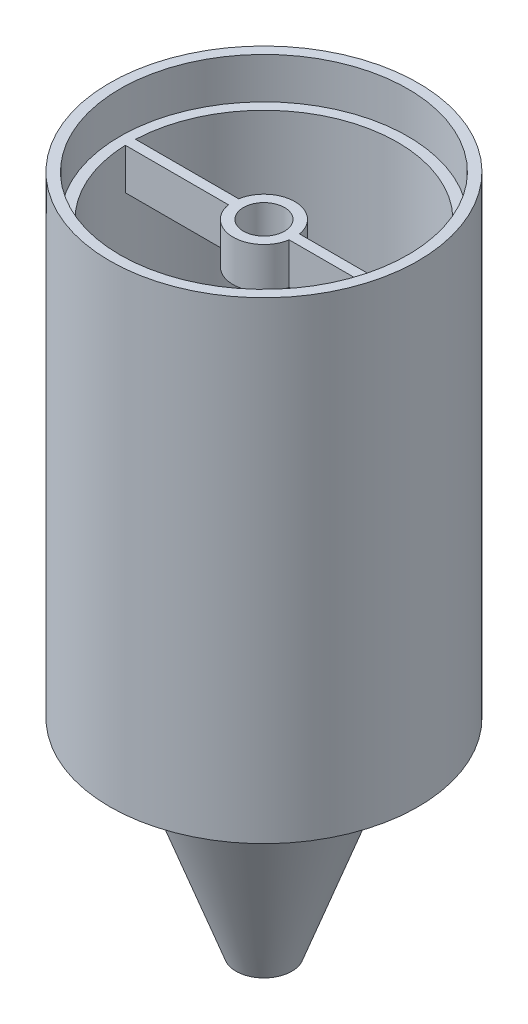
ISO-10303-21;
HEADER;
FILE_DESCRIPTION(('STEP AP214'),'2;1');
FILE_NAME('part.step','',(''),(''),'','','');
FILE_SCHEMA(('AUTOMOTIVE_DESIGN { 1 0 10303 214 1 1 1 1 }'));
ENDSEC;
DATA;
#1=APPLICATION_CONTEXT('core data for automotive mechanical design processes');
#2=APPLICATION_PROTOCOL_DEFINITION('international standard','automotive_design',2000,#1);
#3=PRODUCT_CONTEXT('',#1,'mechanical');
#4=PRODUCT('Part','Part','',(#3));
#5=PRODUCT_RELATED_PRODUCT_CATEGORY('part','',(#4));
#6=PRODUCT_DEFINITION_FORMATION('','',#4);
#7=PRODUCT_DEFINITION_CONTEXT('part definition',#1,'design');
#8=PRODUCT_DEFINITION('design','',#6,#7);
#9=PRODUCT_DEFINITION_SHAPE('','',#8);
#10=(LENGTH_UNIT() NAMED_UNIT(*) SI_UNIT(.MILLI.,.METRE.));
#11=(NAMED_UNIT(*) PLANE_ANGLE_UNIT() SI_UNIT($,.RADIAN.));
#12=(NAMED_UNIT(*) SI_UNIT($,.STERADIAN.) SOLID_ANGLE_UNIT());
#13=UNCERTAINTY_MEASURE_WITH_UNIT(LENGTH_MEASURE(1.E-05),#10,'distance_accuracy_value','');
#14=(GEOMETRIC_REPRESENTATION_CONTEXT(3) GLOBAL_UNCERTAINTY_ASSIGNED_CONTEXT((#13)) GLOBAL_UNIT_ASSIGNED_CONTEXT((#10,
#11,#12)) REPRESENTATION_CONTEXT('',''));
#15=CARTESIAN_POINT('',(0.,0.,0.));
#16=DIRECTION('',(0.,0.,1.));
#17=DIRECTION('',(1.,0.,0.));
#18=AXIS2_PLACEMENT_3D('',#15,#16,#17);
#19=CARTESIAN_POINT('',(0.,53.34,0.));
#20=DIRECTION('',(0.,-1.,0.));
#21=DIRECTION('',(0.,0.,-1.));
#22=AXIS2_PLACEMENT_3D('',#19,#20,#21);
#23=CYLINDRICAL_SURFACE('',#22,16.51);
#24=CARTESIAN_POINT('',(0.,2.54,0.));
#25=DIRECTION('',(0.,1.,0.));
#26=DIRECTION('',(0.,0.,1.));
#27=AXIS2_PLACEMENT_3D('',#24,#25,#26);
#28=CIRCLE('',#27,16.51);
#29=CARTESIAN_POINT('',(0.,2.54,16.51));
#30=VERTEX_POINT('',#29);
#31=EDGE_CURVE('E181',#30,#30,#28,.F.);
#32=ORIENTED_EDGE('',*,*,#31,.T.);
#33=EDGE_LOOP('',(#32));
#34=FACE_BOUND('',#33,.T.);
#35=CARTESIAN_POINT('',(0.,48.26,0.));
#36=DIRECTION('',(0.,1.,0.));
#37=DIRECTION('',(0.,0.,1.));
#38=AXIS2_PLACEMENT_3D('',#35,#36,#37);
#39=CIRCLE('',#38,16.51);
#40=CARTESIAN_POINT('',(-16.4977839420936,48.26,-0.635000000000003));
#41=VERTEX_POINT('',#40);
#42=CARTESIAN_POINT('',(-16.4977839420936,48.26,0.634999999999997));
#43=VERTEX_POINT('',#42);
#44=EDGE_CURVE('E183',#41,#43,#39,.T.);
#45=ORIENTED_EDGE('',*,*,#44,.T.);
#46=DIRECTION('',(0.,1.,0.));
#47=VECTOR('',#46,1.);
#48=CARTESIAN_POINT('',(-16.4977839420936,48.26,0.634999999999997));
#49=LINE('',#48,#47);
#50=CARTESIAN_POINT('',(-16.4977839420936,53.34,0.634999999999997));
#51=VERTEX_POINT('',#50);
#52=EDGE_CURVE('E105',#43,#51,#49,.T.);
#53=ORIENTED_EDGE('',*,*,#52,.T.);
#54=CARTESIAN_POINT('',(0.,53.34,0.));
#55=DIRECTION('',(0.,1.,0.));
#56=DIRECTION('',(0.,0.,1.));
#57=AXIS2_PLACEMENT_3D('',#54,#55,#56);
#58=CIRCLE('',#57,16.51);
#59=CARTESIAN_POINT('',(16.4977839420936,53.34,0.634999999999997));
#60=VERTEX_POINT('',#59);
#61=EDGE_CURVE('E160',#51,#60,#58,.T.);
#62=ORIENTED_EDGE('',*,*,#61,.T.);
#63=DIRECTION('',(0.,1.,0.));
#64=VECTOR('',#63,1.);
#65=CARTESIAN_POINT('',(16.4977839420936,48.26,0.634999999999997));
#66=LINE('',#65,#64);
#67=CARTESIAN_POINT('',(16.4977839420936,48.26,0.634999999999997));
#68=VERTEX_POINT('',#67);
#69=EDGE_CURVE('E113',#68,#60,#66,.T.);
#70=ORIENTED_EDGE('',*,*,#69,.F.);
#71=CARTESIAN_POINT('',(16.4977839420936,48.26,-0.635000000000003));
#72=VERTEX_POINT('',#71);
#73=EDGE_CURVE('E41',#68,#72,#39,.T.);
#74=ORIENTED_EDGE('',*,*,#73,.T.);
#75=DIRECTION('',(0.,1.,0.));
#76=VECTOR('',#75,1.);
#77=CARTESIAN_POINT('',(16.4977839420936,48.26,-0.635000000000003));
#78=LINE('',#77,#76);
#79=CARTESIAN_POINT('',(16.4977839420936,53.34,-0.635000000000003));
#80=VERTEX_POINT('',#79);
#81=EDGE_CURVE('E148',#72,#80,#78,.T.);
#82=ORIENTED_EDGE('',*,*,#81,.T.);
#83=CARTESIAN_POINT('',(-16.4977839420936,53.34,-0.635000000000003));
#84=VERTEX_POINT('',#83);
#85=EDGE_CURVE('E165',#80,#84,#58,.T.);
#86=ORIENTED_EDGE('',*,*,#85,.T.);
#87=DIRECTION('',(0.,1.,0.));
#88=VECTOR('',#87,1.);
#89=CARTESIAN_POINT('',(-16.4977839420936,48.26,-0.635000000000003));
#90=LINE('',#89,#88);
#91=EDGE_CURVE('E141',#41,#84,#90,.T.);
#92=ORIENTED_EDGE('',*,*,#91,.F.);
#93=EDGE_LOOP('',(#45,#53,#62,#70,#74,#82,#86,#92));
#94=FACE_BOUND('',#93,.T.);
#95=ADVANCED_FACE('F33',(#34,#94),#23,.F.);
#96=CARTESIAN_POINT('',(0.,0.,0.));
#97=DIRECTION('',(0.,1.,0.));
#98=DIRECTION('',(0.,0.,1.));
#99=AXIS2_PLACEMENT_3D('',#96,#97,#98);
#100=PLANE('',#99);
#101=CARTESIAN_POINT('',(0.,0.,0.));
#102=DIRECTION('',(0.,1.,0.));
#103=DIRECTION('',(0.,0.,1.));
#104=AXIS2_PLACEMENT_3D('',#101,#102,#103);
#105=CIRCLE('',#104,19.05);
#106=CARTESIAN_POINT('',(0.,0.,19.05));
#107=VERTEX_POINT('',#106);
#108=EDGE_CURVE('E175',#107,#107,#105,.T.);
#109=ORIENTED_EDGE('',*,*,#108,.F.);
#110=EDGE_LOOP('',(#109));
#111=FACE_BOUND('',#110,.T.);
#112=CARTESIAN_POINT('',(0.,0.,0.));
#113=DIRECTION('',(0.,1.,0.));
#114=DIRECTION('',(0.,0.,1.));
#115=AXIS2_PLACEMENT_3D('',#112,#113,#114);
#116=CIRCLE('',#115,12.7);
#117=CARTESIAN_POINT('',(0.,0.,12.7));
#118=VERTEX_POINT('',#117);
#119=EDGE_CURVE('E178',#118,#118,#116,.F.);
#120=ORIENTED_EDGE('',*,*,#119,.F.);
#121=EDGE_LOOP('',(#120));
#122=FACE_BOUND('',#121,.T.);
#123=ADVANCED_FACE('F227',(#111,#122),#100,.F.);
#124=CARTESIAN_POINT('',(0.,2.54,0.));
#125=DIRECTION('',(0.,-1.,0.));
#126=DIRECTION('',(0.,0.,-1.));
#127=AXIS2_PLACEMENT_3D('',#124,#125,#126);
#128=CYLINDRICAL_SURFACE('',#127,19.05);
#129=ORIENTED_EDGE('',*,*,#108,.T.);
#130=EDGE_LOOP('',(#129));
#131=FACE_BOUND('',#130,.T.);
#132=CARTESIAN_POINT('',(0.,58.42,0.));
#133=DIRECTION('',(0.,1.,0.));
#134=DIRECTION('',(0.,0.,1.));
#135=AXIS2_PLACEMENT_3D('',#132,#133,#134);
#136=CIRCLE('',#135,19.05);
#137=CARTESIAN_POINT('',(0.,58.42,19.05));
#138=VERTEX_POINT('',#137);
#139=EDGE_CURVE('E124',#138,#138,#136,.T.);
#140=ORIENTED_EDGE('',*,*,#139,.F.);
#141=EDGE_LOOP('',(#140));
#142=FACE_BOUND('',#141,.T.);
#143=ADVANCED_FACE('F35',(#131,#142),#128,.T.);
#144=CARTESIAN_POINT('',(0.,2.54,0.));
#145=DIRECTION('',(0.,1.,0.));
#146=DIRECTION('',(0.,0.,1.));
#147=AXIS2_PLACEMENT_3D('',#144,#145,#146);
#148=PLANE('',#147);
#149=ORIENTED_EDGE('',*,*,#31,.F.);
#150=EDGE_LOOP('',(#149));
#151=FACE_BOUND('',#150,.T.);
#152=CARTESIAN_POINT('',(0.,2.54,0.));
#153=DIRECTION('',(0.,1.,0.));
#154=DIRECTION('',(0.,0.,1.));
#155=AXIS2_PLACEMENT_3D('',#152,#153,#154);
#156=CIRCLE('',#155,12.7093283453977);
#157=CARTESIAN_POINT('',(0.,2.54,12.7093283453977));
#158=VERTEX_POINT('',#157);
#159=EDGE_CURVE('E170',#158,#158,#156,.F.);
#160=ORIENTED_EDGE('',*,*,#159,.T.);
#161=EDGE_LOOP('',(#160));
#162=FACE_BOUND('',#161,.T.);
#163=ADVANCED_FACE('F245',(#151,#162),#148,.T.);
#164=CARTESIAN_POINT('',(0.,0.,0.));
#165=DIRECTION('',(0.,1.,0.));
#166=DIRECTION('',(0.,0.,-1.));
#167=AXIS2_PLACEMENT_3D('',#164,#165,#166);
#168=CONICAL_SURFACE('',#167,12.7,0.349065850398867);
#169=CARTESIAN_POINT('',(0.,-25.4,0.));
#170=DIRECTION('',(0.,-1.,0.));
#171=DIRECTION('',(0.,0.,-1.));
#172=AXIS2_PLACEMENT_3D('',#169,#170,#171);
#173=CIRCLE('',#172,3.45515604963844);
#174=CARTESIAN_POINT('',(0.,-25.4,-3.45515604963844));
#175=VERTEX_POINT('',#174);
#176=EDGE_CURVE('E169',#175,#175,#173,.T.);
#177=ORIENTED_EDGE('',*,*,#176,.F.);
#178=EDGE_LOOP('',(#177));
#179=FACE_BOUND('',#178,.T.);
#180=ORIENTED_EDGE('',*,*,#119,.T.);
#181=EDGE_LOOP('',(#180));
#182=FACE_BOUND('',#181,.T.);
#183=ADVANCED_FACE('F241',(#179,#182),#168,.T.);
#184=CARTESIAN_POINT('',(0.,-25.4,0.));
#185=DIRECTION('',(0.,-1.,0.));
#186=DIRECTION('',(0.,0.,-1.));
#187=AXIS2_PLACEMENT_3D('',#184,#185,#186);
#188=PLANE('',#187);
#189=CARTESIAN_POINT('',(0.,-25.4,0.));
#190=DIRECTION('',(0.,-1.,0.));
#191=DIRECTION('',(0.,0.,-1.));
#192=AXIS2_PLACEMENT_3D('',#189,#190,#191);
#193=CIRCLE('',#192,2.54);
#194=CARTESIAN_POINT('',(0.,-25.4,-2.54));
#195=VERTEX_POINT('',#194);
#196=EDGE_CURVE('E166',#195,#195,#193,.T.);
#197=ORIENTED_EDGE('',*,*,#196,.F.);
#198=EDGE_LOOP('',(#197));
#199=FACE_BOUND('',#198,.T.);
#200=ORIENTED_EDGE('',*,*,#176,.T.);
#201=EDGE_LOOP('',(#200));
#202=FACE_BOUND('',#201,.T.);
#203=ADVANCED_FACE('F237',(#199,#202),#188,.T.);
#204=CARTESIAN_POINT('',(0.,-25.4,0.));
#205=DIRECTION('',(0.,1.,0.));
#206=DIRECTION('',(0.,0.,-1.));
#207=AXIS2_PLACEMENT_3D('',#204,#205,#206);
#208=CONICAL_SURFACE('',#207,2.54,0.349065850398867);
#209=ORIENTED_EDGE('',*,*,#159,.F.);
#210=EDGE_LOOP('',(#209));
#211=FACE_BOUND('',#210,.T.);
#212=ORIENTED_EDGE('',*,*,#196,.T.);
#213=EDGE_LOOP('',(#212));
#214=FACE_BOUND('',#213,.T.);
#215=ADVANCED_FACE('F207',(#211,#214),#208,.F.);
#216=CARTESIAN_POINT('',(0.,53.34,0.));
#217=DIRECTION('',(0.,1.,0.));
#218=DIRECTION('',(0.,0.,1.));
#219=AXIS2_PLACEMENT_3D('',#216,#217,#218);
#220=PLANE('',#219);
#221=CARTESIAN_POINT('',(0.,53.34,0.));
#222=DIRECTION('',(0.,1.,0.));
#223=DIRECTION('',(0.,0.,1.));
#224=AXIS2_PLACEMENT_3D('',#221,#222,#223);
#225=CIRCLE('',#224,17.78);
#226=CARTESIAN_POINT('',(0.,53.34,17.78));
#227=VERTEX_POINT('',#226);
#228=EDGE_CURVE('E11',#227,#227,#225,.F.);
#229=ORIENTED_EDGE('',*,*,#228,.F.);
#230=EDGE_LOOP('',(#229));
#231=FACE_BOUND('',#230,.T.);
#232=ORIENTED_EDGE('',*,*,#85,.F.);
#233=DIRECTION('',(1.,0.,0.));
#234=VECTOR('',#233,1.);
#235=CARTESIAN_POINT('',(3.75671066226826,53.34,-0.635000000000003));
#236=LINE('',#235,#234);
#237=CARTESIAN_POINT('',(3.75671066226826,53.34,-0.635000000000003));
#238=VERTEX_POINT('',#237);
#239=EDGE_CURVE('E135',#238,#80,#236,.T.);
#240=ORIENTED_EDGE('',*,*,#239,.F.);
#241=CARTESIAN_POINT('',(0.,53.34,0.));
#242=DIRECTION('',(0.,-1.,0.));
#243=DIRECTION('',(0.,0.,-1.));
#244=AXIS2_PLACEMENT_3D('',#241,#242,#243);
#245=CIRCLE('',#244,3.81);
#246=CARTESIAN_POINT('',(-3.75671066226826,53.34,-0.635000000000001));
#247=VERTEX_POINT('',#246);
#248=EDGE_CURVE('E144',#247,#238,#245,.T.);
#249=ORIENTED_EDGE('',*,*,#248,.F.);
#250=DIRECTION('',(1.,0.,0.));
#251=VECTOR('',#250,1.);
#252=CARTESIAN_POINT('',(-3.75671066226826,53.34,-0.635000000000003));
#253=LINE('',#252,#251);
#254=EDGE_CURVE('E127',#84,#247,#253,.T.);
#255=ORIENTED_EDGE('',*,*,#254,.F.);
#256=EDGE_LOOP('',(#232,#240,#249,#255));
#257=FACE_BOUND('',#256,.T.);
#258=DIRECTION('',(-1.,0.,0.));
#259=VECTOR('',#258,1.);
#260=CARTESIAN_POINT('',(3.75671066226826,53.34,0.634999999999997));
#261=LINE('',#260,#259);
#262=CARTESIAN_POINT('',(3.75671066226826,53.34,0.634999999999997));
#263=VERTEX_POINT('',#262);
#264=EDGE_CURVE('E121',#60,#263,#261,.T.);
#265=ORIENTED_EDGE('',*,*,#264,.F.);
#266=ORIENTED_EDGE('',*,*,#61,.F.);
#267=DIRECTION('',(-1.,0.,0.));
#268=VECTOR('',#267,1.);
#269=CARTESIAN_POINT('',(-3.75671066226826,53.34,0.634999999999997));
#270=LINE('',#269,#268);
#271=CARTESIAN_POINT('',(-3.75671066226826,53.34,0.634999999999998));
#272=VERTEX_POINT('',#271);
#273=EDGE_CURVE('E56',#272,#51,#270,.T.);
#274=ORIENTED_EDGE('',*,*,#273,.F.);
#275=CARTESIAN_POINT('',(0.,53.34,0.));
#276=DIRECTION('',(0.,-1.,0.));
#277=DIRECTION('',(0.,0.,1.));
#278=AXIS2_PLACEMENT_3D('',#275,#276,#277);
#279=CIRCLE('',#278,3.81);
#280=EDGE_CURVE('E104',#263,#272,#279,.T.);
#281=ORIENTED_EDGE('',*,*,#280,.F.);
#282=EDGE_LOOP('',(#265,#266,#274,#281));
#283=FACE_BOUND('',#282,.T.);
#284=CARTESIAN_POINT('',(0.,53.34,0.));
#285=DIRECTION('',(0.,1.,0.));
#286=DIRECTION('',(0.,0.,1.));
#287=AXIS2_PLACEMENT_3D('',#284,#285,#286);
#288=CIRCLE('',#287,2.54);
#289=CARTESIAN_POINT('',(0.,53.34,2.54));
#290=VERTEX_POINT('',#289);
#291=EDGE_CURVE('E151',#290,#290,#288,.T.);
#292=ORIENTED_EDGE('',*,*,#291,.F.);
#293=EDGE_LOOP('',(#292));
#294=FACE_BOUND('',#293,.T.);
#295=ADVANCED_FACE('F204',(#231,#257,#283,#294),#220,.T.);
#296=CARTESIAN_POINT('',(0.,48.26,0.));
#297=DIRECTION('',(0.,1.,0.));
#298=DIRECTION('',(0.,0.,1.));
#299=AXIS2_PLACEMENT_3D('',#296,#297,#298);
#300=PLANE('',#299);
#301=ORIENTED_EDGE('',*,*,#73,.F.);
#302=DIRECTION('',(-1.,0.,0.));
#303=VECTOR('',#302,1.);
#304=CARTESIAN_POINT('',(3.75671066226826,48.26,0.634999999999997));
#305=LINE('',#304,#303);
#306=CARTESIAN_POINT('',(3.75671066226826,48.26,0.634999999999997));
#307=VERTEX_POINT('',#306);
#308=EDGE_CURVE('E48',#68,#307,#305,.T.);
#309=ORIENTED_EDGE('',*,*,#308,.T.);
#310=CARTESIAN_POINT('',(0.,48.26,0.));
#311=DIRECTION('',(0.,-1.,0.));
#312=DIRECTION('',(0.,0.,1.));
#313=AXIS2_PLACEMENT_3D('',#310,#311,#312);
#314=CIRCLE('',#313,3.81);
#315=CARTESIAN_POINT('',(-3.75671066226826,48.26,0.634999999999998));
#316=VERTEX_POINT('',#315);
#317=EDGE_CURVE('E102',#307,#316,#314,.T.);
#318=ORIENTED_EDGE('',*,*,#317,.T.);
#319=DIRECTION('',(-1.,0.,0.));
#320=VECTOR('',#319,1.);
#321=CARTESIAN_POINT('',(-3.75671066226826,48.26,0.634999999999997));
#322=LINE('',#321,#320);
#323=EDGE_CURVE('E109',#316,#43,#322,.T.);
#324=ORIENTED_EDGE('',*,*,#323,.T.);
#325=ORIENTED_EDGE('',*,*,#44,.F.);
#326=DIRECTION('',(1.,0.,0.));
#327=VECTOR('',#326,1.);
#328=CARTESIAN_POINT('',(-3.75671066226826,48.26,-0.635000000000003));
#329=LINE('',#328,#327);
#330=CARTESIAN_POINT('',(-3.75671066226826,48.26,-0.635000000000003));
#331=VERTEX_POINT('',#330);
#332=EDGE_CURVE('E131',#41,#331,#329,.T.);
#333=ORIENTED_EDGE('',*,*,#332,.T.);
#334=CARTESIAN_POINT('',(0.,48.26,0.));
#335=DIRECTION('',(0.,-1.,0.));
#336=DIRECTION('',(0.,0.,-1.));
#337=AXIS2_PLACEMENT_3D('',#334,#335,#336);
#338=CIRCLE('',#337,3.81);
#339=CARTESIAN_POINT('',(3.75671066226826,48.26,-0.635000000000003));
#340=VERTEX_POINT('',#339);
#341=EDGE_CURVE('E134',#331,#340,#338,.T.);
#342=ORIENTED_EDGE('',*,*,#341,.T.);
#343=DIRECTION('',(1.,0.,0.));
#344=VECTOR('',#343,1.);
#345=CARTESIAN_POINT('',(3.75671066226826,48.26,-0.635000000000003));
#346=LINE('',#345,#344);
#347=EDGE_CURVE('E138',#340,#72,#346,.T.);
#348=ORIENTED_EDGE('',*,*,#347,.T.);
#349=EDGE_LOOP('',(#301,#309,#318,#324,#325,#333,#342,#348));
#350=FACE_BOUND('',#349,.T.);
#351=CARTESIAN_POINT('',(0.,48.26,0.));
#352=DIRECTION('',(0.,1.,0.));
#353=DIRECTION('',(0.,0.,1.));
#354=AXIS2_PLACEMENT_3D('',#351,#352,#353);
#355=CIRCLE('',#354,2.54);
#356=CARTESIAN_POINT('',(0.,48.26,2.54));
#357=VERTEX_POINT('',#356);
#358=EDGE_CURVE('E157',#357,#357,#355,.T.);
#359=ORIENTED_EDGE('',*,*,#358,.T.);
#360=EDGE_LOOP('',(#359));
#361=FACE_BOUND('',#360,.T.);
#362=ADVANCED_FACE('F115',(#350,#361),#300,.F.);
#363=CARTESIAN_POINT('',(0.,48.26,0.));
#364=DIRECTION('',(0.,1.,0.));
#365=DIRECTION('',(0.,0.,1.));
#366=AXIS2_PLACEMENT_3D('',#363,#364,#365);
#367=CYLINDRICAL_SURFACE('',#366,2.54);
#368=ORIENTED_EDGE('',*,*,#358,.F.);
#369=EDGE_LOOP('',(#368));
#370=FACE_BOUND('',#369,.T.);
#371=ORIENTED_EDGE('',*,*,#291,.T.);
#372=EDGE_LOOP('',(#371));
#373=FACE_BOUND('',#372,.T.);
#374=ADVANCED_FACE('F214',(#370,#373),#367,.F.);
#375=CARTESIAN_POINT('',(3.75671066226826,48.26,-0.635000000000003));
#376=DIRECTION('',(0.,0.,1.));
#377=DIRECTION('',(1.,0.,0.));
#378=AXIS2_PLACEMENT_3D('',#375,#376,#377);
#379=PLANE('',#378);
#380=ORIENTED_EDGE('',*,*,#239,.T.);
#381=ORIENTED_EDGE('',*,*,#81,.F.);
#382=ORIENTED_EDGE('',*,*,#347,.F.);
#383=DIRECTION('',(0.,1.,0.));
#384=VECTOR('',#383,1.);
#385=CARTESIAN_POINT('',(3.75671066226826,48.26,-0.635000000000003));
#386=LINE('',#385,#384);
#387=EDGE_CURVE('E152',#340,#238,#386,.T.);
#388=ORIENTED_EDGE('',*,*,#387,.T.);
#389=EDGE_LOOP('',(#380,#381,#382,#388));
#390=FACE_BOUND('',#389,.T.);
#391=ADVANCED_FACE('F201',(#390),#379,.F.);
#392=CARTESIAN_POINT('',(0.,48.26,0.));
#393=DIRECTION('',(0.,1.,0.));
#394=DIRECTION('',(0.,0.,1.));
#395=AXIS2_PLACEMENT_3D('',#392,#393,#394);
#396=CYLINDRICAL_SURFACE('',#395,3.81);
#397=ORIENTED_EDGE('',*,*,#248,.T.);
#398=ORIENTED_EDGE('',*,*,#387,.F.);
#399=ORIENTED_EDGE('',*,*,#341,.F.);
#400=DIRECTION('',(0.,1.,0.));
#401=VECTOR('',#400,1.);
#402=CARTESIAN_POINT('',(-3.75671066226826,48.26,-0.635000000000001));
#403=LINE('',#402,#401);
#404=EDGE_CURVE('E154',#331,#247,#403,.T.);
#405=ORIENTED_EDGE('',*,*,#404,.T.);
#406=EDGE_LOOP('',(#397,#398,#399,#405));
#407=FACE_BOUND('',#406,.T.);
#408=ADVANCED_FACE('F197',(#407),#396,.T.);
#409=CARTESIAN_POINT('',(-3.75671066226826,48.26,-0.635000000000003));
#410=DIRECTION('',(0.,0.,1.));
#411=DIRECTION('',(1.,0.,0.));
#412=AXIS2_PLACEMENT_3D('',#409,#410,#411);
#413=PLANE('',#412);
#414=ORIENTED_EDGE('',*,*,#254,.T.);
#415=ORIENTED_EDGE('',*,*,#404,.F.);
#416=ORIENTED_EDGE('',*,*,#332,.F.);
#417=ORIENTED_EDGE('',*,*,#91,.T.);
#418=EDGE_LOOP('',(#414,#415,#416,#417));
#419=FACE_BOUND('',#418,.T.);
#420=ADVANCED_FACE('F193',(#419),#413,.F.);
#421=CARTESIAN_POINT('',(-3.75671066226826,48.26,0.634999999999997));
#422=DIRECTION('',(0.,0.,-1.));
#423=DIRECTION('',(-1.,0.,0.));
#424=AXIS2_PLACEMENT_3D('',#421,#422,#423);
#425=PLANE('',#424);
#426=ORIENTED_EDGE('',*,*,#273,.T.);
#427=ORIENTED_EDGE('',*,*,#52,.F.);
#428=ORIENTED_EDGE('',*,*,#323,.F.);
#429=DIRECTION('',(0.,1.,0.));
#430=VECTOR('',#429,1.);
#431=CARTESIAN_POINT('',(-3.75671066226826,48.26,0.634999999999998));
#432=LINE('',#431,#430);
#433=EDGE_CURVE('E98',#316,#272,#432,.T.);
#434=ORIENTED_EDGE('',*,*,#433,.T.);
#435=EDGE_LOOP('',(#426,#427,#428,#434));
#436=FACE_BOUND('',#435,.T.);
#437=ADVANCED_FACE('F110',(#436),#425,.F.);
#438=CARTESIAN_POINT('',(0.,48.26,0.));
#439=DIRECTION('',(0.,1.,0.));
#440=DIRECTION('',(0.,0.,1.));
#441=AXIS2_PLACEMENT_3D('',#438,#439,#440);
#442=CYLINDRICAL_SURFACE('',#441,3.81);
#443=ORIENTED_EDGE('',*,*,#280,.T.);
#444=ORIENTED_EDGE('',*,*,#433,.F.);
#445=ORIENTED_EDGE('',*,*,#317,.F.);
#446=DIRECTION('',(0.,1.,0.));
#447=VECTOR('',#446,1.);
#448=CARTESIAN_POINT('',(3.75671066226826,48.26,0.634999999999997));
#449=LINE('',#448,#447);
#450=EDGE_CURVE('E106',#307,#263,#449,.T.);
#451=ORIENTED_EDGE('',*,*,#450,.T.);
#452=EDGE_LOOP('',(#443,#444,#445,#451));
#453=FACE_BOUND('',#452,.T.);
#454=ADVANCED_FACE('F100',(#453),#442,.T.);
#455=CARTESIAN_POINT('',(3.75671066226826,48.26,0.634999999999997));
#456=DIRECTION('',(0.,0.,-1.));
#457=DIRECTION('',(-1.,0.,0.));
#458=AXIS2_PLACEMENT_3D('',#455,#456,#457);
#459=PLANE('',#458);
#460=ORIENTED_EDGE('',*,*,#264,.T.);
#461=ORIENTED_EDGE('',*,*,#450,.F.);
#462=ORIENTED_EDGE('',*,*,#308,.F.);
#463=ORIENTED_EDGE('',*,*,#69,.T.);
#464=EDGE_LOOP('',(#460,#461,#462,#463));
#465=FACE_BOUND('',#464,.T.);
#466=ADVANCED_FACE('F280',(#465),#459,.F.);
#467=CARTESIAN_POINT('',(0.,58.42,0.));
#468=DIRECTION('',(0.,1.,0.));
#469=DIRECTION('',(0.,0.,1.));
#470=AXIS2_PLACEMENT_3D('',#467,#468,#469);
#471=PLANE('',#470);
#472=ORIENTED_EDGE('',*,*,#139,.T.);
#473=EDGE_LOOP('',(#472));
#474=FACE_BOUND('',#473,.T.);
#475=CARTESIAN_POINT('',(0.,58.42,0.));
#476=DIRECTION('',(0.,1.,0.));
#477=DIRECTION('',(0.,0.,1.));
#478=AXIS2_PLACEMENT_3D('',#475,#476,#477);
#479=CIRCLE('',#478,17.78);
#480=CARTESIAN_POINT('',(0.,58.42,17.78));
#481=VERTEX_POINT('',#480);
#482=EDGE_CURVE('E270',#481,#481,#479,.T.);
#483=ORIENTED_EDGE('',*,*,#482,.F.);
#484=EDGE_LOOP('',(#483));
#485=FACE_BOUND('',#484,.T.);
#486=ADVANCED_FACE('F278',(#474,#485),#471,.T.);
#487=CARTESIAN_POINT('',(0.,58.42,0.));
#488=DIRECTION('',(0.,-1.,0.));
#489=DIRECTION('',(0.,0.,-1.));
#490=AXIS2_PLACEMENT_3D('',#487,#488,#489);
#491=CYLINDRICAL_SURFACE('',#490,17.78);
#492=ORIENTED_EDGE('',*,*,#482,.T.);
#493=EDGE_LOOP('',(#492));
#494=FACE_BOUND('',#493,.T.);
#495=ORIENTED_EDGE('',*,*,#228,.T.);
#496=EDGE_LOOP('',(#495));
#497=FACE_BOUND('',#496,.T.);
#498=ADVANCED_FACE('F275',(#494,#497),#491,.F.);
#499=CLOSED_SHELL('',(#95,#123,#143,#163,#183,#203,#215,#295,#362,#374,#391,#408,#420,#437,#454,
#466,#486,#498));
#500=MANIFOLD_SOLID_BREP('B2',#499);
#501=ADVANCED_BREP_SHAPE_REPRESENTATION('',(#18,#500),#14);
#502=SHAPE_DEFINITION_REPRESENTATION(#9,#501);
ENDSEC;
END-ISO-10303-21;
